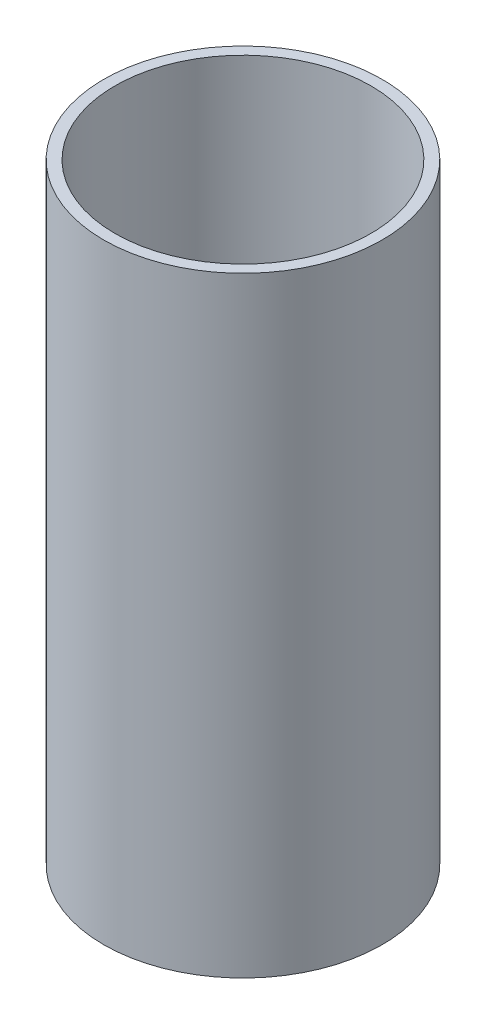
ISO-10303-21;
HEADER;
FILE_DESCRIPTION(('STEP AP214'),'2;1');
FILE_NAME('part.step','',(''),(''),'','','');
FILE_SCHEMA(('AUTOMOTIVE_DESIGN { 1 0 10303 214 1 1 1 1 }'));
ENDSEC;
DATA;
#1=APPLICATION_CONTEXT('core data for automotive mechanical design processes');
#2=APPLICATION_PROTOCOL_DEFINITION('international standard','automotive_design',2000,#1);
#3=PRODUCT_CONTEXT('',#1,'mechanical');
#4=PRODUCT('Part','Part','',(#3));
#5=PRODUCT_RELATED_PRODUCT_CATEGORY('part','',(#4));
#6=PRODUCT_DEFINITION_FORMATION('','',#4);
#7=PRODUCT_DEFINITION_CONTEXT('part definition',#1,'design');
#8=PRODUCT_DEFINITION('design','',#6,#7);
#9=PRODUCT_DEFINITION_SHAPE('','',#8);
#10=(LENGTH_UNIT() NAMED_UNIT(*) SI_UNIT(.MILLI.,.METRE.));
#11=(NAMED_UNIT(*) PLANE_ANGLE_UNIT() SI_UNIT($,.RADIAN.));
#12=(NAMED_UNIT(*) SI_UNIT($,.STERADIAN.) SOLID_ANGLE_UNIT());
#13=UNCERTAINTY_MEASURE_WITH_UNIT(LENGTH_MEASURE(1.E-05),#10,'distance_accuracy_value','');
#14=(GEOMETRIC_REPRESENTATION_CONTEXT(3) GLOBAL_UNCERTAINTY_ASSIGNED_CONTEXT((#13)) GLOBAL_UNIT_ASSIGNED_CONTEXT((#10,
#11,#12)) REPRESENTATION_CONTEXT('',''));
#15=CARTESIAN_POINT('',(0.,0.,0.));
#16=DIRECTION('',(0.,0.,1.));
#17=DIRECTION('',(1.,0.,0.));
#18=AXIS2_PLACEMENT_3D('',#15,#16,#17);
#19=CARTESIAN_POINT('',(0.,30.2199119985306,0.));
#20=DIRECTION('',(0.,1.,0.));
#21=DIRECTION('',(0.,0.,1.));
#22=AXIS2_PLACEMENT_3D('',#19,#20,#21);
#23=CYLINDRICAL_SURFACE('',#22,23.9);
#24=CARTESIAN_POINT('',(0.,30.2199119985306,0.));
#25=DIRECTION('',(0.,1.,0.));
#26=DIRECTION('',(0.,0.,1.));
#27=AXIS2_PLACEMENT_3D('',#24,#25,#26);
#28=CIRCLE('',#27,23.9);
#29=CARTESIAN_POINT('',(0.,30.2199119985306,23.9));
#30=VERTEX_POINT('',#29);
#31=EDGE_CURVE('E28',#30,#30,#28,.F.);
#32=ORIENTED_EDGE('',*,*,#31,.F.);
#33=EDGE_LOOP('',(#32));
#34=FACE_BOUND('',#33,.T.);
#35=CARTESIAN_POINT('',(0.,-83.7800880014694,0.));
#36=DIRECTION('',(0.,1.,0.));
#37=DIRECTION('',(0.,0.,1.));
#38=AXIS2_PLACEMENT_3D('',#35,#36,#37);
#39=CIRCLE('',#38,23.9);
#40=CARTESIAN_POINT('',(0.,-83.7800880014694,23.9));
#41=VERTEX_POINT('',#40);
#42=EDGE_CURVE('E19',#41,#41,#39,.T.);
#43=ORIENTED_EDGE('',*,*,#42,.F.);
#44=EDGE_LOOP('',(#43));
#45=FACE_BOUND('',#44,.T.);
#46=ADVANCED_FACE('F16',(#34,#45),#23,.F.);
#47=CARTESIAN_POINT('',(-26.,-83.7800880014694,0.));
#48=DIRECTION('',(0.,-1.,0.));
#49=DIRECTION('',(0.,0.,-1.));
#50=AXIS2_PLACEMENT_3D('',#47,#48,#49);
#51=PLANE('',#50);
#52=CARTESIAN_POINT('',(0.,-83.7800880014694,0.));
#53=DIRECTION('',(0.,1.,0.));
#54=DIRECTION('',(0.,0.,1.));
#55=AXIS2_PLACEMENT_3D('',#52,#53,#54);
#56=CIRCLE('',#55,26.);
#57=CARTESIAN_POINT('',(0.,-83.7800880014694,26.));
#58=VERTEX_POINT('',#57);
#59=EDGE_CURVE('E23',#58,#58,#56,.T.);
#60=ORIENTED_EDGE('',*,*,#59,.F.);
#61=EDGE_LOOP('',(#60));
#62=FACE_BOUND('',#61,.T.);
#63=ORIENTED_EDGE('',*,*,#42,.T.);
#64=EDGE_LOOP('',(#63));
#65=FACE_BOUND('',#64,.T.);
#66=ADVANCED_FACE('F36',(#62,#65),#51,.T.);
#67=CARTESIAN_POINT('',(-26.,30.2199119985306,0.));
#68=DIRECTION('',(0.,1.,0.));
#69=DIRECTION('',(0.,0.,1.));
#70=AXIS2_PLACEMENT_3D('',#67,#68,#69);
#71=PLANE('',#70);
#72=ORIENTED_EDGE('',*,*,#31,.T.);
#73=EDGE_LOOP('',(#72));
#74=FACE_BOUND('',#73,.T.);
#75=CARTESIAN_POINT('',(0.,30.2199119985306,0.));
#76=DIRECTION('',(0.,1.,0.));
#77=DIRECTION('',(0.,0.,1.));
#78=AXIS2_PLACEMENT_3D('',#75,#76,#77);
#79=CIRCLE('',#78,26.);
#80=CARTESIAN_POINT('',(0.,30.2199119985306,26.));
#81=VERTEX_POINT('',#80);
#82=EDGE_CURVE('E10',#81,#81,#79,.F.);
#83=ORIENTED_EDGE('',*,*,#82,.F.);
#84=EDGE_LOOP('',(#83));
#85=FACE_BOUND('',#84,.T.);
#86=ADVANCED_FACE('F43',(#74,#85),#71,.T.);
#87=CARTESIAN_POINT('',(0.,30.2199119985306,0.));
#88=DIRECTION('',(0.,1.,0.));
#89=DIRECTION('',(0.,0.,1.));
#90=AXIS2_PLACEMENT_3D('',#87,#88,#89);
#91=CYLINDRICAL_SURFACE('',#90,26.);
#92=ORIENTED_EDGE('',*,*,#82,.T.);
#93=EDGE_LOOP('',(#92));
#94=FACE_BOUND('',#93,.T.);
#95=ORIENTED_EDGE('',*,*,#59,.T.);
#96=EDGE_LOOP('',(#95));
#97=FACE_BOUND('',#96,.T.);
#98=ADVANCED_FACE('F45',(#94,#97),#91,.T.);
#99=CLOSED_SHELL('',(#46,#66,#86,#98));
#100=MANIFOLD_SOLID_BREP('B1',#99);
#101=ADVANCED_BREP_SHAPE_REPRESENTATION('',(#18,#100),#14);
#102=SHAPE_DEFINITION_REPRESENTATION(#9,#101);
ENDSEC;
END-ISO-10303-21;
